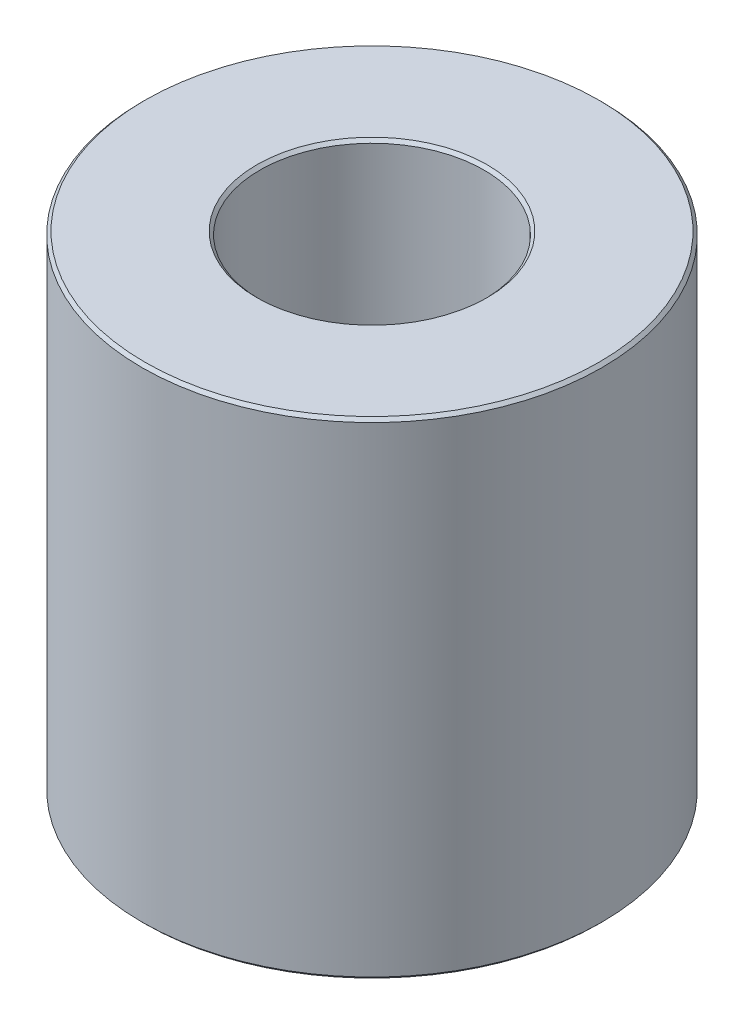
ISO-10303-21;
HEADER;
FILE_DESCRIPTION(('STEP AP214'),'2;1');
FILE_NAME('part.step','',(''),(''),'','','');
FILE_SCHEMA(('AUTOMOTIVE_DESIGN { 1 0 10303 214 1 1 1 1 }'));
ENDSEC;
DATA;
#1=APPLICATION_CONTEXT('core data for automotive mechanical design processes');
#2=APPLICATION_PROTOCOL_DEFINITION('international standard','automotive_design',2000,#1);
#3=PRODUCT_CONTEXT('',#1,'mechanical');
#4=PRODUCT('Part','Part','',(#3));
#5=PRODUCT_RELATED_PRODUCT_CATEGORY('part','',(#4));
#6=PRODUCT_DEFINITION_FORMATION('','',#4);
#7=PRODUCT_DEFINITION_CONTEXT('part definition',#1,'design');
#8=PRODUCT_DEFINITION('design','',#6,#7);
#9=PRODUCT_DEFINITION_SHAPE('','',#8);
#10=(LENGTH_UNIT() NAMED_UNIT(*) SI_UNIT(.MILLI.,.METRE.));
#11=(NAMED_UNIT(*) PLANE_ANGLE_UNIT() SI_UNIT($,.RADIAN.));
#12=(NAMED_UNIT(*) SI_UNIT($,.STERADIAN.) SOLID_ANGLE_UNIT());
#13=UNCERTAINTY_MEASURE_WITH_UNIT(LENGTH_MEASURE(1.E-05),#10,'distance_accuracy_value','');
#14=(GEOMETRIC_REPRESENTATION_CONTEXT(3) GLOBAL_UNCERTAINTY_ASSIGNED_CONTEXT((#13)) GLOBAL_UNIT_ASSIGNED_CONTEXT((#10,
#11,#12)) REPRESENTATION_CONTEXT('',''));
#15=CARTESIAN_POINT('',(0.,0.,0.));
#16=DIRECTION('',(0.,0.,1.));
#17=DIRECTION('',(1.,0.,0.));
#18=AXIS2_PLACEMENT_3D('',#15,#16,#17);
#19=CARTESIAN_POINT('',(0.,79.2723325685472,0.));
#20=DIRECTION('',(0.,-1.,0.));
#21=DIRECTION('',(0.,0.,-1.));
#22=AXIS2_PLACEMENT_3D('',#19,#20,#21);
#23=CYLINDRICAL_SURFACE('',#22,37.5);
#24=CARTESIAN_POINT('',(0.,0.500498882479328,0.));
#25=DIRECTION('',(0.,1.,0.));
#26=DIRECTION('',(0.,0.,1.));
#27=AXIS2_PLACEMENT_3D('',#24,#25,#26);
#28=CIRCLE('',#27,37.5);
#29=CARTESIAN_POINT('',(0.,0.500498882479328,37.5));
#30=VERTEX_POINT('',#29);
#31=EDGE_CURVE('E10',#30,#30,#28,.T.);
#32=ORIENTED_EDGE('',*,*,#31,.T.);
#33=EDGE_LOOP('',(#32));
#34=FACE_BOUND('',#33,.T.);
#35=CARTESIAN_POINT('',(0.,78.7718336860679,0.));
#36=DIRECTION('',(0.,1.,0.));
#37=DIRECTION('',(0.,0.,1.));
#38=AXIS2_PLACEMENT_3D('',#35,#36,#37);
#39=CIRCLE('',#38,37.5);
#40=CARTESIAN_POINT('',(0.,78.7718336860679,37.5));
#41=VERTEX_POINT('',#40);
#42=EDGE_CURVE('E50',#41,#41,#39,.F.);
#43=ORIENTED_EDGE('',*,*,#42,.T.);
#44=EDGE_LOOP('',(#43));
#45=FACE_BOUND('',#44,.T.);
#46=ADVANCED_FACE('F39',(#34,#45),#23,.T.);
#47=CARTESIAN_POINT('',(0.,79.2723325685472,0.));
#48=DIRECTION('',(0.,1.,0.));
#49=DIRECTION('',(0.,0.,1.));
#50=AXIS2_PLACEMENT_3D('',#47,#48,#49);
#51=PLANE('',#50);
#52=CARTESIAN_POINT('',(0.,79.2723325685472,0.));
#53=DIRECTION('',(0.,1.,0.));
#54=DIRECTION('',(0.,0.,1.));
#55=AXIS2_PLACEMENT_3D('',#52,#53,#54);
#56=CIRCLE('',#55,18.7738383489586);
#57=CARTESIAN_POINT('',(0.,79.2723325685472,18.7738383489586));
#58=VERTEX_POINT('',#57);
#59=EDGE_CURVE('E58',#58,#58,#56,.F.);
#60=ORIENTED_EDGE('',*,*,#59,.T.);
#61=EDGE_LOOP('',(#60));
#62=FACE_BOUND('',#61,.T.);
#63=CARTESIAN_POINT('',(0.,79.2723325685472,0.));
#64=DIRECTION('',(0.,1.,0.));
#65=DIRECTION('',(0.,0.,1.));
#66=AXIS2_PLACEMENT_3D('',#63,#64,#65);
#67=CIRCLE('',#66,36.9995011175206);
#68=CARTESIAN_POINT('',(0.,79.2723325685472,36.9995011175206));
#69=VERTEX_POINT('',#68);
#70=EDGE_CURVE('E61',#69,#69,#67,.T.);
#71=ORIENTED_EDGE('',*,*,#70,.T.);
#72=EDGE_LOOP('',(#71));
#73=FACE_BOUND('',#72,.T.);
#74=ADVANCED_FACE('F88',(#62,#73),#51,.T.);
#75=CARTESIAN_POINT('',(0.,0.,0.));
#76=DIRECTION('',(0.,1.,0.));
#77=DIRECTION('',(0.,0.,1.));
#78=AXIS2_PLACEMENT_3D('',#75,#76,#77);
#79=PLANE('',#78);
#80=CARTESIAN_POINT('',(0.,0.,0.));
#81=DIRECTION('',(0.,1.,0.));
#82=DIRECTION('',(0.,0.,1.));
#83=AXIS2_PLACEMENT_3D('',#80,#81,#82);
#84=CIRCLE('',#83,18.7738383489585);
#85=CARTESIAN_POINT('',(0.,0.,18.7738383489585));
#86=VERTEX_POINT('',#85);
#87=EDGE_CURVE('E51',#86,#86,#84,.T.);
#88=ORIENTED_EDGE('',*,*,#87,.T.);
#89=EDGE_LOOP('',(#88));
#90=FACE_BOUND('',#89,.T.);
#91=CARTESIAN_POINT('',(0.,0.,0.));
#92=DIRECTION('',(0.,1.,0.));
#93=DIRECTION('',(0.,0.,1.));
#94=AXIS2_PLACEMENT_3D('',#91,#92,#93);
#95=CIRCLE('',#94,36.9995011175207);
#96=CARTESIAN_POINT('',(0.,0.,36.9995011175207));
#97=VERTEX_POINT('',#96);
#98=EDGE_CURVE('E54',#97,#97,#95,.F.);
#99=ORIENTED_EDGE('',*,*,#98,.T.);
#100=EDGE_LOOP('',(#99));
#101=FACE_BOUND('',#100,.T.);
#102=ADVANCED_FACE('F83',(#90,#101),#79,.F.);
#103=CARTESIAN_POINT('',(0.,79.2723325685472,0.));
#104=DIRECTION('',(0.,-1.,0.));
#105=DIRECTION('',(0.,0.,-1.));
#106=AXIS2_PLACEMENT_3D('',#103,#104,#105);
#107=CYLINDRICAL_SURFACE('',#106,18.2733394664792);
#108=CARTESIAN_POINT('',(0.,78.7718336860678,0.));
#109=DIRECTION('',(0.,1.,0.));
#110=DIRECTION('',(0.,0.,1.));
#111=AXIS2_PLACEMENT_3D('',#108,#109,#110);
#112=CIRCLE('',#111,18.2733394664792);
#113=CARTESIAN_POINT('',(0.,78.7718336860678,18.2733394664792));
#114=VERTEX_POINT('',#113);
#115=EDGE_CURVE('E67',#114,#114,#112,.T.);
#116=ORIENTED_EDGE('',*,*,#115,.T.);
#117=EDGE_LOOP('',(#116));
#118=FACE_BOUND('',#117,.T.);
#119=CARTESIAN_POINT('',(0.,0.500498882479342,0.));
#120=DIRECTION('',(0.,1.,0.));
#121=DIRECTION('',(0.,0.,1.));
#122=AXIS2_PLACEMENT_3D('',#119,#120,#121);
#123=CIRCLE('',#122,18.2733394664792);
#124=CARTESIAN_POINT('',(0.,0.500498882479342,18.2733394664792));
#125=VERTEX_POINT('',#124);
#126=EDGE_CURVE('E69',#125,#125,#123,.F.);
#127=ORIENTED_EDGE('',*,*,#126,.T.);
#128=EDGE_LOOP('',(#127));
#129=FACE_BOUND('',#128,.T.);
#130=ADVANCED_FACE('F71',(#118,#129),#107,.F.);
#131=CARTESIAN_POINT('',(0.,78.7718336860678,0.));
#132=DIRECTION('',(0.,1.,0.));
#133=DIRECTION('',(0.,0.,1.));
#134=AXIS2_PLACEMENT_3D('',#131,#132,#133);
#135=CONICAL_SURFACE('',#134,18.2733394664792,0.785398163397441);
#136=ORIENTED_EDGE('',*,*,#59,.F.);
#137=EDGE_LOOP('',(#136));
#138=FACE_BOUND('',#137,.T.);
#139=ORIENTED_EDGE('',*,*,#115,.F.);
#140=EDGE_LOOP('',(#139));
#141=FACE_BOUND('',#140,.T.);
#142=ADVANCED_FACE('F77',(#138,#141),#135,.F.);
#143=CARTESIAN_POINT('',(0.,0.,0.));
#144=DIRECTION('',(0.,-1.,0.));
#145=DIRECTION('',(0.,0.,-1.));
#146=AXIS2_PLACEMENT_3D('',#143,#144,#145);
#147=CONICAL_SURFACE('',#146,18.7738383489585,0.785398163397441);
#148=ORIENTED_EDGE('',*,*,#126,.F.);
#149=EDGE_LOOP('',(#148));
#150=FACE_BOUND('',#149,.T.);
#151=ORIENTED_EDGE('',*,*,#87,.F.);
#152=EDGE_LOOP('',(#151));
#153=FACE_BOUND('',#152,.T.);
#154=ADVANCED_FACE('F73',(#150,#153),#147,.F.);
#155=CARTESIAN_POINT('',(0.,0.500498882479328,0.));
#156=DIRECTION('',(0.,1.,0.));
#157=DIRECTION('',(0.,0.,1.));
#158=AXIS2_PLACEMENT_3D('',#155,#156,#157);
#159=CONICAL_SURFACE('',#158,37.5,0.785398163397448);
#160=ORIENTED_EDGE('',*,*,#98,.F.);
#161=EDGE_LOOP('',(#160));
#162=FACE_BOUND('',#161,.T.);
#163=ORIENTED_EDGE('',*,*,#31,.F.);
#164=EDGE_LOOP('',(#163));
#165=FACE_BOUND('',#164,.T.);
#166=ADVANCED_FACE('F76',(#162,#165),#159,.T.);
#167=CARTESIAN_POINT('',(0.,79.2723325685472,0.));
#168=DIRECTION('',(0.,-1.,0.));
#169=DIRECTION('',(0.,0.,-1.));
#170=AXIS2_PLACEMENT_3D('',#167,#168,#169);
#171=CONICAL_SURFACE('',#170,36.9995011175206,0.785398163397448);
#172=ORIENTED_EDGE('',*,*,#42,.F.);
#173=EDGE_LOOP('',(#172));
#174=FACE_BOUND('',#173,.T.);
#175=ORIENTED_EDGE('',*,*,#70,.F.);
#176=EDGE_LOOP('',(#175));
#177=FACE_BOUND('',#176,.T.);
#178=ADVANCED_FACE('F45',(#174,#177),#171,.T.);
#179=CLOSED_SHELL('',(#46,#74,#102,#130,#142,#154,#166,#178));
#180=MANIFOLD_SOLID_BREP('B2',#179);
#181=ADVANCED_BREP_SHAPE_REPRESENTATION('',(#18,#180),#14);
#182=SHAPE_DEFINITION_REPRESENTATION(#9,#181);
ENDSEC;
END-ISO-10303-21;
